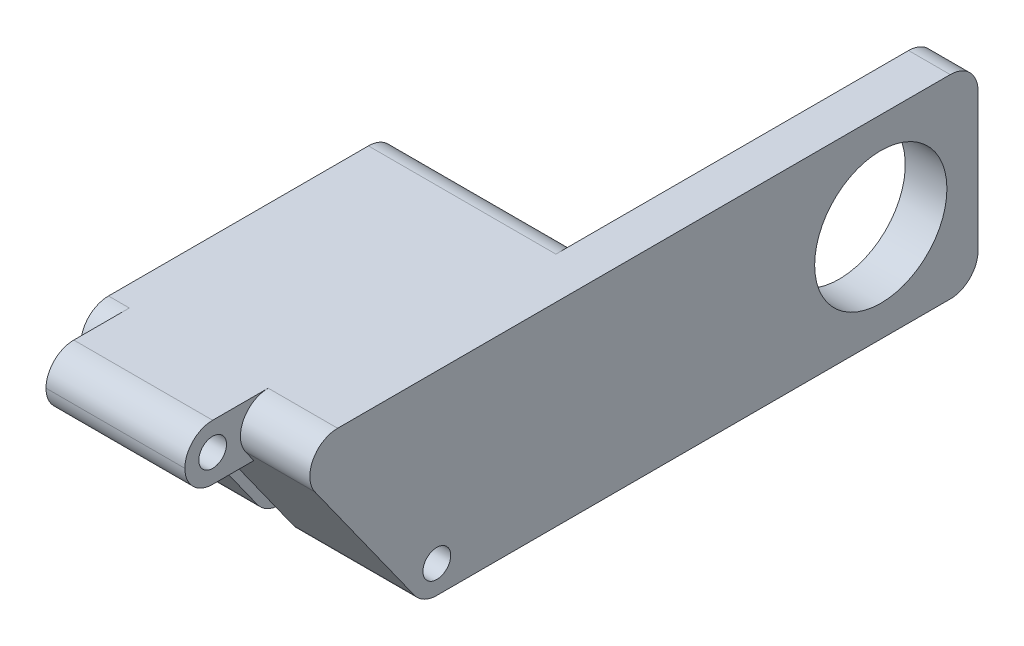
ISO-10303-21;
HEADER;
FILE_DESCRIPTION(('STEP AP214'),'2;1');
FILE_NAME('part.step','',(''),(''),'','','');
FILE_SCHEMA(('AUTOMOTIVE_DESIGN { 1 0 10303 214 1 1 1 1 }'));
ENDSEC;
DATA;
#1=APPLICATION_CONTEXT('core data for automotive mechanical design processes');
#2=APPLICATION_PROTOCOL_DEFINITION('international standard','automotive_design',2000,#1);
#3=PRODUCT_CONTEXT('',#1,'mechanical');
#4=PRODUCT('Part','Part','',(#3));
#5=PRODUCT_RELATED_PRODUCT_CATEGORY('part','',(#4));
#6=PRODUCT_DEFINITION_FORMATION('','',#4);
#7=PRODUCT_DEFINITION_CONTEXT('part definition',#1,'design');
#8=PRODUCT_DEFINITION('design','',#6,#7);
#9=PRODUCT_DEFINITION_SHAPE('','',#8);
#10=(LENGTH_UNIT() NAMED_UNIT(*) SI_UNIT(.MILLI.,.METRE.));
#11=(NAMED_UNIT(*) PLANE_ANGLE_UNIT() SI_UNIT($,.RADIAN.));
#12=(NAMED_UNIT(*) SI_UNIT($,.STERADIAN.) SOLID_ANGLE_UNIT());
#13=UNCERTAINTY_MEASURE_WITH_UNIT(LENGTH_MEASURE(1.E-05),#10,'distance_accuracy_value','');
#14=(GEOMETRIC_REPRESENTATION_CONTEXT(3) GLOBAL_UNCERTAINTY_ASSIGNED_CONTEXT((#13)) GLOBAL_UNIT_ASSIGNED_CONTEXT((#10,
#11,#12)) REPRESENTATION_CONTEXT('',''));
#15=CARTESIAN_POINT('',(0.,0.,0.));
#16=DIRECTION('',(0.,0.,1.));
#17=DIRECTION('',(1.,0.,0.));
#18=AXIS2_PLACEMENT_3D('',#15,#16,#17);
#19=CARTESIAN_POINT('',(-10.,6.99999999999999,46.1136213522735));
#20=DIRECTION('',(0.,-1.,0.));
#21=DIRECTION('',(0.,0.,-1.));
#22=AXIS2_PLACEMENT_3D('',#19,#20,#21);
#23=PLANE('',#22);
#24=DIRECTION('',(1.,0.,0.));
#25=VECTOR('',#24,1.);
#26=CARTESIAN_POINT('',(-10.,6.99999999999999,46.1136213522735));
#27=LINE('',#26,#25);
#28=CARTESIAN_POINT('',(-6.5,6.99999999999999,46.1136213522735));
#29=VERTEX_POINT('',#28);
#30=CARTESIAN_POINT('',(-5.,6.99999999999999,46.1136213522735));
#31=VERTEX_POINT('',#30);
#32=EDGE_CURVE('E328',#29,#31,#27,.T.);
#33=ORIENTED_EDGE('',*,*,#32,.T.);
#34=DIRECTION('',(0.,0.,-1.));
#35=VECTOR('',#34,1.);
#36=CARTESIAN_POINT('',(-5.,7.00000000000001,52.1136213522735));
#37=LINE('',#36,#35);
#38=CARTESIAN_POINT('',(-5.,7.00000000000001,50.1136213522735));
#39=VERTEX_POINT('',#38);
#40=EDGE_CURVE('E392',#39,#31,#37,.T.);
#41=ORIENTED_EDGE('',*,*,#40,.F.);
#42=DIRECTION('',(-1.,0.,0.));
#43=VECTOR('',#42,1.);
#44=CARTESIAN_POINT('',(-5.,6.99999999999999,50.1136213522735));
#45=LINE('',#44,#43);
#46=CARTESIAN_POINT('',(5.,7.00000000000001,50.1136213522735));
#47=VERTEX_POINT('',#46);
#48=EDGE_CURVE('E268',#47,#39,#45,.T.);
#49=ORIENTED_EDGE('',*,*,#48,.F.);
#50=DIRECTION('',(0.,0.,1.));
#51=VECTOR('',#50,1.);
#52=CARTESIAN_POINT('',(5.,7.00000000000001,52.1136213522735));
#53=LINE('',#52,#51);
#54=CARTESIAN_POINT('',(5.,6.99999999999999,46.1136213522735));
#55=VERTEX_POINT('',#54);
#56=EDGE_CURVE('E397',#55,#47,#53,.T.);
#57=ORIENTED_EDGE('',*,*,#56,.F.);
#58=CARTESIAN_POINT('',(10.,6.99999999999999,46.1136213522735));
#59=VERTEX_POINT('',#58);
#60=EDGE_CURVE('E331',#55,#59,#27,.T.);
#61=ORIENTED_EDGE('',*,*,#60,.T.);
#62=DIRECTION('',(0.,0.,1.));
#63=VECTOR('',#62,1.);
#64=CARTESIAN_POINT('',(10.,6.99999999999999,46.1136213522735));
#65=LINE('',#64,#63);
#66=CARTESIAN_POINT('',(10.,7.00000000000001,2.00000000000001));
#67=VERTEX_POINT('',#66);
#68=EDGE_CURVE('E365',#67,#59,#65,.T.);
#69=ORIENTED_EDGE('',*,*,#68,.F.);
#70=DIRECTION('',(1.,0.,0.));
#71=VECTOR('',#70,1.);
#72=CARTESIAN_POINT('',(-10.,7.00000000000001,2.00000000000001));
#73=LINE('',#72,#71);
#74=CARTESIAN_POINT('',(7.,7.00000000000001,2.00000000000001));
#75=VERTEX_POINT('',#74);
#76=EDGE_CURVE('E324',#75,#67,#73,.T.);
#77=ORIENTED_EDGE('',*,*,#76,.F.);
#78=DIRECTION('',(0.,0.,-1.));
#79=VECTOR('',#78,1.);
#80=CARTESIAN_POINT('',(7.,6.99999999999999,46.1136213522735));
#81=LINE('',#80,#79);
#82=CARTESIAN_POINT('',(7.,7.,27.3960780543711));
#83=VERTEX_POINT('',#82);
#84=EDGE_CURVE('E227',#83,#75,#81,.T.);
#85=ORIENTED_EDGE('',*,*,#84,.F.);
#86=DIRECTION('',(1.,0.,0.));
#87=VECTOR('',#86,1.);
#88=CARTESIAN_POINT('',(7.,7.,27.3960780543711));
#89=LINE('',#88,#87);
#90=CARTESIAN_POINT('',(-6.5,7.,27.3960780543711));
#91=VERTEX_POINT('',#90);
#92=EDGE_CURVE('E209',#91,#83,#89,.T.);
#93=ORIENTED_EDGE('',*,*,#92,.F.);
#94=DIRECTION('',(0.,0.,-1.));
#95=VECTOR('',#94,1.);
#96=CARTESIAN_POINT('',(-6.5,6.99999999999999,46.1136213522735));
#97=LINE('',#96,#95);
#98=EDGE_CURVE('E215',#29,#91,#97,.T.);
#99=ORIENTED_EDGE('',*,*,#98,.F.);
#100=EDGE_LOOP('',(#33,#41,#49,#57,#61,#69,#77,#85,#93,#99));
#101=FACE_BOUND('',#100,.T.);
#102=ADVANCED_FACE('F49',(#101),#23,.F.);
#103=CARTESIAN_POINT('',(-10.,-7.,38.9707642094164));
#104=DIRECTION('',(0.,1.,0.));
#105=DIRECTION('',(0.,0.,1.));
#106=AXIS2_PLACEMENT_3D('',#103,#104,#105);
#107=PLANE('',#106);
#108=DIRECTION('',(1.,0.,0.));
#109=VECTOR('',#108,1.);
#110=CARTESIAN_POINT('',(-7.,-6.99999999999998,27.3960780543711));
#111=LINE('',#110,#109);
#112=CARTESIAN_POINT('',(7.,-6.99999999999998,27.3960780543711));
#113=VERTEX_POINT('',#112);
#114=CARTESIAN_POINT('',(-6.5,-6.99999999999998,27.3960780543711));
#115=VERTEX_POINT('',#114);
#116=EDGE_CURVE('E230',#113,#115,#111,.F.);
#117=ORIENTED_EDGE('',*,*,#116,.F.);
#118=DIRECTION('',(0.,0.,1.));
#119=VECTOR('',#118,1.);
#120=CARTESIAN_POINT('',(7.,-7.,38.9707642094164));
#121=LINE('',#120,#119);
#122=CARTESIAN_POINT('',(7.,-6.99999999999993,2.00000000000002));
#123=VERTEX_POINT('',#122);
#124=EDGE_CURVE('E253',#123,#113,#121,.T.);
#125=ORIENTED_EDGE('',*,*,#124,.F.);
#126=DIRECTION('',(1.,0.,0.));
#127=VECTOR('',#126,1.);
#128=CARTESIAN_POINT('',(-10.,-6.99999999999993,2.00000000000001));
#129=LINE('',#128,#127);
#130=CARTESIAN_POINT('',(10.,-6.99999999999993,2.00000000000001));
#131=VERTEX_POINT('',#130);
#132=EDGE_CURVE('E347',#123,#131,#129,.T.);
#133=ORIENTED_EDGE('',*,*,#132,.T.);
#134=DIRECTION('',(0.,0.,-1.));
#135=VECTOR('',#134,1.);
#136=CARTESIAN_POINT('',(10.,-7.,38.9707642094164));
#137=LINE('',#136,#135);
#138=CARTESIAN_POINT('',(10.,-7.,38.9707642094164));
#139=VERTEX_POINT('',#138);
#140=EDGE_CURVE('E351',#139,#131,#137,.T.);
#141=ORIENTED_EDGE('',*,*,#140,.F.);
#142=DIRECTION('',(1.,0.,0.));
#143=VECTOR('',#142,1.);
#144=CARTESIAN_POINT('',(-10.,-7.,38.9707642094164));
#145=LINE('',#144,#143);
#146=CARTESIAN_POINT('',(1.3,-7.00000000000001,38.9707642094164));
#147=VERTEX_POINT('',#146);
#148=EDGE_CURVE('E346',#147,#139,#145,.T.);
#149=ORIENTED_EDGE('',*,*,#148,.F.);
#150=DIRECTION('',(0.,0.,-1.));
#151=VECTOR('',#150,1.);
#152=CARTESIAN_POINT('',(1.3,-7.00000000000001,36.5982311518299));
#153=LINE('',#152,#151);
#154=CARTESIAN_POINT('',(1.3,-7.,36.5982311518299));
#155=VERTEX_POINT('',#154);
#156=EDGE_CURVE('E445',#147,#155,#153,.T.);
#157=ORIENTED_EDGE('',*,*,#156,.T.);
#158=DIRECTION('',(-1.,0.,0.));
#159=VECTOR('',#158,1.);
#160=CARTESIAN_POINT('',(-1.3,-7.00000000000001,36.5982311518299));
#161=LINE('',#160,#159);
#162=CARTESIAN_POINT('',(-1.3,-7.00000000000001,36.5982311518299));
#163=VERTEX_POINT('',#162);
#164=EDGE_CURVE('E441',#155,#163,#161,.T.);
#165=ORIENTED_EDGE('',*,*,#164,.T.);
#166=DIRECTION('',(0.,0.,1.));
#167=VECTOR('',#166,1.);
#168=CARTESIAN_POINT('',(-1.3,-7.00000000000001,36.5982311518299));
#169=LINE('',#168,#167);
#170=CARTESIAN_POINT('',(-1.3,-7.00000000000001,38.9707642094164));
#171=VERTEX_POINT('',#170);
#172=EDGE_CURVE('E436',#163,#171,#169,.T.);
#173=ORIENTED_EDGE('',*,*,#172,.T.);
#174=CARTESIAN_POINT('',(-6.5,-7.,38.9707642094164));
#175=VERTEX_POINT('',#174);
#176=EDGE_CURVE('E342',#175,#171,#145,.T.);
#177=ORIENTED_EDGE('',*,*,#176,.F.);
#178=DIRECTION('',(0.,0.,1.));
#179=VECTOR('',#178,1.);
#180=CARTESIAN_POINT('',(-6.5,-7.,38.9707642094164));
#181=LINE('',#180,#179);
#182=EDGE_CURVE('E483',#115,#175,#181,.T.);
#183=ORIENTED_EDGE('',*,*,#182,.F.);
#184=EDGE_LOOP('',(#117,#125,#133,#141,#149,#157,#165,#173,#177,#183));
#185=FACE_BOUND('',#184,.T.);
#186=ADVANCED_FACE('F528',(#185),#107,.F.);
#187=CARTESIAN_POINT('',(-10.,-5.00000000000001,38.9707642094164));
#188=DIRECTION('',(1.,0.,0.));
#189=DIRECTION('',(0.,0.,1.));
#190=AXIS2_PLACEMENT_3D('',#187,#188,#189);
#191=CYLINDRICAL_SURFACE('',#190,1.99999999999999);
#192=ORIENTED_EDGE('',*,*,#148,.T.);
#193=CARTESIAN_POINT('',(10.,-5.00000000000001,38.9707642094164));
#194=DIRECTION('',(1.,0.,0.));
#195=DIRECTION('',(0.,0.,-1.));
#196=AXIS2_PLACEMENT_3D('',#193,#194,#195);
#197=CIRCLE('',#196,1.99999999999999);
#198=CARTESIAN_POINT('',(10.,-6.16247638743819,40.5982311518299));
#199=VERTEX_POINT('',#198);
#200=EDGE_CURVE('E355',#199,#139,#197,.T.);
#201=ORIENTED_EDGE('',*,*,#200,.F.);
#202=DIRECTION('',(1.,0.,0.));
#203=VECTOR('',#202,1.);
#204=CARTESIAN_POINT('',(-10.,-6.16247638743819,40.5982311518299));
#205=LINE('',#204,#203);
#206=CARTESIAN_POINT('',(1.3,-6.16247638743819,40.5982311518299));
#207=VERTEX_POINT('',#206);
#208=EDGE_CURVE('E341',#207,#199,#205,.T.);
#209=ORIENTED_EDGE('',*,*,#208,.F.);
#210=CARTESIAN_POINT('',(1.3,-5.00000000000001,38.9707642094164));
#211=DIRECTION('',(-1.,0.,0.));
#212=DIRECTION('',(0.,0.,1.));
#213=AXIS2_PLACEMENT_3D('',#210,#211,#212);
#214=CIRCLE('',#213,1.99999999999999);
#215=EDGE_CURVE('E273',#147,#207,#214,.T.);
#216=ORIENTED_EDGE('',*,*,#215,.F.);
#217=EDGE_LOOP('',(#192,#201,#209,#216));
#218=FACE_BOUND('',#217,.T.);
#219=ADVANCED_FACE('F562',(#218),#191,.T.);
#220=CARTESIAN_POINT('',(-10.,-5.00000000000001,38.9707642094164));
#221=DIRECTION('',(1.,0.,0.));
#222=DIRECTION('',(0.,0.,1.));
#223=AXIS2_PLACEMENT_3D('',#220,#221,#222);
#224=CYLINDRICAL_SURFACE('',#223,0.999999999999998);
#225=CARTESIAN_POINT('',(1.3,-5.00000000000001,38.9707642094164));
#226=DIRECTION('',(-1.,0.,0.));
#227=DIRECTION('',(0.,0.,1.));
#228=AXIS2_PLACEMENT_3D('',#225,#226,#227);
#229=CIRCLE('',#228,0.999999999999998);
#230=CARTESIAN_POINT('',(1.3,-5.00000000000001,39.9707642094164));
#231=VERTEX_POINT('',#230);
#232=EDGE_CURVE('E269',#231,#231,#229,.T.);
#233=ORIENTED_EDGE('',*,*,#232,.T.);
#234=EDGE_LOOP('',(#233));
#235=FACE_BOUND('',#234,.T.);
#236=CARTESIAN_POINT('',(10.,-5.00000000000001,38.9707642094164));
#237=DIRECTION('',(1.,0.,0.));
#238=DIRECTION('',(0.,0.,-1.));
#239=AXIS2_PLACEMENT_3D('',#236,#237,#238);
#240=CIRCLE('',#239,0.999999999999998);
#241=CARTESIAN_POINT('',(10.,-5.00000000000001,37.9707642094164));
#242=VERTEX_POINT('',#241);
#243=EDGE_CURVE('E380',#242,#242,#240,.T.);
#244=ORIENTED_EDGE('',*,*,#243,.T.);
#245=EDGE_LOOP('',(#244));
#246=FACE_BOUND('',#245,.T.);
#247=ADVANCED_FACE('F636',(#235,#246),#224,.F.);
#248=CARTESIAN_POINT('',(-10.,4.99999999999999,46.1136213522735));
#249=DIRECTION('',(1.,0.,0.));
#250=DIRECTION('',(0.,0.,1.));
#251=AXIS2_PLACEMENT_3D('',#248,#249,#250);
#252=CYLINDRICAL_SURFACE('',#251,2.);
#253=DIRECTION('',(1.,0.,0.));
#254=VECTOR('',#253,1.);
#255=CARTESIAN_POINT('',(-10.,3.8375236125618,47.741088294687));
#256=LINE('',#255,#254);
#257=CARTESIAN_POINT('',(5.,3.8375236125618,47.741088294687));
#258=VERTEX_POINT('',#257);
#259=CARTESIAN_POINT('',(10.,3.8375236125618,47.741088294687));
#260=VERTEX_POINT('',#259);
#261=EDGE_CURVE('E336',#258,#260,#256,.T.);
#262=ORIENTED_EDGE('',*,*,#261,.T.);
#263=CARTESIAN_POINT('',(10.,4.99999999999999,46.1136213522735));
#264=DIRECTION('',(1.,0.,0.));
#265=DIRECTION('',(0.,0.,1.));
#266=AXIS2_PLACEMENT_3D('',#263,#264,#265);
#267=CIRCLE('',#266,2.);
#268=EDGE_CURVE('E361',#59,#260,#267,.T.);
#269=ORIENTED_EDGE('',*,*,#268,.F.);
#270=ORIENTED_EDGE('',*,*,#60,.F.);
#271=CARTESIAN_POINT('',(5.,4.99999999999999,46.1136213522735));
#272=DIRECTION('',(-1.,0.,0.));
#273=DIRECTION('',(0.,0.,1.));
#274=AXIS2_PLACEMENT_3D('',#271,#272,#273);
#275=CIRCLE('',#274,2.);
#276=EDGE_CURVE('E384',#258,#55,#275,.T.);
#277=ORIENTED_EDGE('',*,*,#276,.F.);
#278=EDGE_LOOP('',(#262,#269,#270,#277));
#279=FACE_BOUND('',#278,.T.);
#280=ADVANCED_FACE('F506',(#279),#252,.T.);
#281=CARTESIAN_POINT('',(10.,-4.99999999999993,2.));
#282=DIRECTION('',(-1.,0.,0.));
#283=DIRECTION('',(0.,0.,-1.));
#284=AXIS2_PLACEMENT_3D('',#281,#282,#283);
#285=PLANE('',#284);
#286=CARTESIAN_POINT('',(10.,0.,7.));
#287=DIRECTION('',(1.,0.,0.));
#288=DIRECTION('',(0.,0.,-1.));
#289=AXIS2_PLACEMENT_3D('',#286,#287,#288);
#290=CIRCLE('',#289,4.7625);
#291=CARTESIAN_POINT('',(10.,0.,2.2375));
#292=VERTEX_POINT('',#291);
#293=EDGE_CURVE('E249',#292,#292,#290,.T.);
#294=ORIENTED_EDGE('',*,*,#293,.F.);
#295=EDGE_LOOP('',(#294));
#296=FACE_BOUND('',#295,.T.);
#297=CARTESIAN_POINT('',(10.,-4.99999999999993,2.));
#298=DIRECTION('',(1.,0.,0.));
#299=DIRECTION('',(0.,0.,-1.));
#300=AXIS2_PLACEMENT_3D('',#297,#298,#299);
#301=CIRCLE('',#300,2.);
#302=CARTESIAN_POINT('',(10.,-4.99999999999991,0.));
#303=VERTEX_POINT('',#302);
#304=EDGE_CURVE('E376',#131,#303,#301,.T.);
#305=ORIENTED_EDGE('',*,*,#304,.T.);
#306=DIRECTION('',(0.,1.,0.));
#307=VECTOR('',#306,1.);
#308=CARTESIAN_POINT('',(10.,-4.99999999999991,0.));
#309=LINE('',#308,#307);
#310=CARTESIAN_POINT('',(10.,4.99999999999999,0.));
#311=VERTEX_POINT('',#310);
#312=EDGE_CURVE('E372',#303,#311,#309,.T.);
#313=ORIENTED_EDGE('',*,*,#312,.T.);
#314=CARTESIAN_POINT('',(10.,5.00000000000001,2.));
#315=DIRECTION('',(1.,0.,0.));
#316=DIRECTION('',(0.,0.,1.));
#317=AXIS2_PLACEMENT_3D('',#314,#315,#316);
#318=CIRCLE('',#317,2.);
#319=EDGE_CURVE('E369',#311,#67,#318,.T.);
#320=ORIENTED_EDGE('',*,*,#319,.T.);
#321=ORIENTED_EDGE('',*,*,#68,.T.);
#322=ORIENTED_EDGE('',*,*,#268,.T.);
#323=DIRECTION('',(0.,-0.813733471206735,-0.581238193719097));
#324=VECTOR('',#323,1.);
#325=CARTESIAN_POINT('',(10.,3.8375236125618,47.741088294687));
#326=LINE('',#325,#324);
#327=EDGE_CURVE('E358',#260,#199,#326,.T.);
#328=ORIENTED_EDGE('',*,*,#327,.T.);
#329=ORIENTED_EDGE('',*,*,#200,.T.);
#330=ORIENTED_EDGE('',*,*,#140,.T.);
#331=EDGE_LOOP('',(#305,#313,#320,#321,#322,#328,#329,#330));
#332=FACE_BOUND('',#331,.T.);
#333=ORIENTED_EDGE('',*,*,#243,.F.);
#334=EDGE_LOOP('',(#333));
#335=FACE_BOUND('',#334,.T.);
#336=ADVANCED_FACE('F509',(#296,#332,#335),#285,.F.);
#337=CARTESIAN_POINT('',(-10.,-4.99999999999993,2.));
#338=DIRECTION('',(1.,0.,0.));
#339=DIRECTION('',(0.,0.,1.));
#340=AXIS2_PLACEMENT_3D('',#337,#338,#339);
#341=CYLINDRICAL_SURFACE('',#340,2.);
#342=DIRECTION('',(1.,0.,0.));
#343=VECTOR('',#342,1.);
#344=CARTESIAN_POINT('',(-10.,-4.99999999999991,0.));
#345=LINE('',#344,#343);
#346=CARTESIAN_POINT('',(7.,-4.99999999999991,0.));
#347=VERTEX_POINT('',#346);
#348=EDGE_CURVE('E318',#347,#303,#345,.T.);
#349=ORIENTED_EDGE('',*,*,#348,.T.);
#350=ORIENTED_EDGE('',*,*,#304,.F.);
#351=ORIENTED_EDGE('',*,*,#132,.F.);
#352=CARTESIAN_POINT('',(7.,-4.99999999999993,2.));
#353=DIRECTION('',(-1.,0.,0.));
#354=DIRECTION('',(0.,0.,1.));
#355=AXIS2_PLACEMENT_3D('',#352,#353,#354);
#356=CIRCLE('',#355,2.);
#357=EDGE_CURVE('E248',#347,#123,#356,.T.);
#358=ORIENTED_EDGE('',*,*,#357,.F.);
#359=EDGE_LOOP('',(#349,#350,#351,#358));
#360=FACE_BOUND('',#359,.T.);
#361=ADVANCED_FACE('F522',(#360),#341,.T.);
#362=CARTESIAN_POINT('',(-10.,-4.99999999999991,0.));
#363=DIRECTION('',(0.,0.,1.));
#364=DIRECTION('',(-1.,0.,0.));
#365=AXIS2_PLACEMENT_3D('',#362,#363,#364);
#366=PLANE('',#365);
#367=DIRECTION('',(1.,0.,0.));
#368=VECTOR('',#367,1.);
#369=CARTESIAN_POINT('',(-10.,4.99999999999999,0.));
#370=LINE('',#369,#368);
#371=CARTESIAN_POINT('',(7.,4.99999999999999,0.));
#372=VERTEX_POINT('',#371);
#373=EDGE_CURVE('E321',#372,#311,#370,.T.);
#374=ORIENTED_EDGE('',*,*,#373,.T.);
#375=ORIENTED_EDGE('',*,*,#312,.F.);
#376=ORIENTED_EDGE('',*,*,#348,.F.);
#377=DIRECTION('',(0.,-1.,0.));
#378=VECTOR('',#377,1.);
#379=CARTESIAN_POINT('',(7.,-4.99999999999991,0.));
#380=LINE('',#379,#378);
#381=EDGE_CURVE('E466',#372,#347,#380,.T.);
#382=ORIENTED_EDGE('',*,*,#381,.F.);
#383=EDGE_LOOP('',(#374,#375,#376,#382));
#384=FACE_BOUND('',#383,.T.);
#385=ADVANCED_FACE('F520',(#384),#366,.F.);
#386=CARTESIAN_POINT('',(-10.,5.00000000000001,2.));
#387=DIRECTION('',(1.,0.,0.));
#388=DIRECTION('',(0.,0.,1.));
#389=AXIS2_PLACEMENT_3D('',#386,#387,#388);
#390=CYLINDRICAL_SURFACE('',#389,2.);
#391=ORIENTED_EDGE('',*,*,#76,.T.);
#392=ORIENTED_EDGE('',*,*,#319,.F.);
#393=ORIENTED_EDGE('',*,*,#373,.F.);
#394=CARTESIAN_POINT('',(7.,5.00000000000001,2.));
#395=DIRECTION('',(-1.,0.,0.));
#396=DIRECTION('',(0.,0.,1.));
#397=AXIS2_PLACEMENT_3D('',#394,#395,#396);
#398=CIRCLE('',#397,2.);
#399=EDGE_CURVE('E463',#75,#372,#398,.T.);
#400=ORIENTED_EDGE('',*,*,#399,.F.);
#401=EDGE_LOOP('',(#391,#392,#393,#400));
#402=FACE_BOUND('',#401,.T.);
#403=ADVANCED_FACE('F515',(#402),#390,.T.);
#404=CARTESIAN_POINT('',(-6.5,3.8375236125618,47.741088294687));
#405=VERTEX_POINT('',#404);
#406=CARTESIAN_POINT('',(-5.,3.8375236125618,47.741088294687));
#407=VERTEX_POINT('',#406);
#408=EDGE_CURVE('E332',#405,#407,#256,.T.);
#409=ORIENTED_EDGE('',*,*,#408,.T.);
#410=CARTESIAN_POINT('',(-5.,4.99999999999999,46.1136213522735));
#411=DIRECTION('',(1.,0.,0.));
#412=DIRECTION('',(0.,0.,-1.));
#413=AXIS2_PLACEMENT_3D('',#410,#411,#412);
#414=CIRCLE('',#413,2.);
#415=EDGE_CURVE('E387',#31,#407,#414,.T.);
#416=ORIENTED_EDGE('',*,*,#415,.F.);
#417=ORIENTED_EDGE('',*,*,#32,.F.);
#418=CARTESIAN_POINT('',(-6.5,4.99999999999999,46.1136213522735));
#419=DIRECTION('',(-1.,0.,0.));
#420=DIRECTION('',(0.,0.,1.));
#421=AXIS2_PLACEMENT_3D('',#418,#419,#420);
#422=CIRCLE('',#421,2.);
#423=EDGE_CURVE('E218',#405,#29,#422,.T.);
#424=ORIENTED_EDGE('',*,*,#423,.F.);
#425=EDGE_LOOP('',(#409,#416,#417,#424));
#426=FACE_BOUND('',#425,.T.);
#427=ADVANCED_FACE('F543',(#426),#252,.T.);
#428=CARTESIAN_POINT('',(-10.,3.8375236125618,47.741088294687));
#429=DIRECTION('',(0.,0.581238193719097,-0.813733471206735));
#430=DIRECTION('',(0.,0.813733471206735,0.581238193719097));
#431=AXIS2_PLACEMENT_3D('',#428,#429,#430);
#432=PLANE('',#431);
#433=CARTESIAN_POINT('',(-6.5,-6.16247638743819,40.5982311518299));
#434=VERTEX_POINT('',#433);
#435=CARTESIAN_POINT('',(-1.3,-6.16247638743819,40.5982311518299));
#436=VERTEX_POINT('',#435);
#437=EDGE_CURVE('E337',#434,#436,#205,.T.);
#438=ORIENTED_EDGE('',*,*,#437,.T.);
#439=DIRECTION('',(0.,-0.813733471206735,-0.581238193719097));
#440=VECTOR('',#439,1.);
#441=CARTESIAN_POINT('',(-1.3,3.8375236125618,47.741088294687));
#442=LINE('',#441,#440);
#443=CARTESIAN_POINT('',(-1.3,-0.562476387438172,44.5982311518299));
#444=VERTEX_POINT('',#443);
#445=EDGE_CURVE('E274',#444,#436,#442,.T.);
#446=ORIENTED_EDGE('',*,*,#445,.F.);
#447=DIRECTION('',(-1.,0.,0.));
#448=VECTOR('',#447,1.);
#449=CARTESIAN_POINT('',(-10.,-0.562476387438169,44.5982311518299));
#450=LINE('',#449,#448);
#451=CARTESIAN_POINT('',(1.3,-0.562476387438169,44.5982311518299));
#452=VERTEX_POINT('',#451);
#453=EDGE_CURVE('E257',#452,#444,#450,.T.);
#454=ORIENTED_EDGE('',*,*,#453,.F.);
#455=DIRECTION('',(0.,0.813733471206735,0.581238193719097));
#456=VECTOR('',#455,1.);
#457=CARTESIAN_POINT('',(1.3,3.8375236125618,47.741088294687));
#458=LINE('',#457,#456);
#459=EDGE_CURVE('E285',#207,#452,#458,.T.);
#460=ORIENTED_EDGE('',*,*,#459,.F.);
#461=ORIENTED_EDGE('',*,*,#208,.T.);
#462=ORIENTED_EDGE('',*,*,#327,.F.);
#463=ORIENTED_EDGE('',*,*,#261,.F.);
#464=DIRECTION('',(0.,0.813733471206735,0.581238193719097));
#465=VECTOR('',#464,1.);
#466=CARTESIAN_POINT('',(5.,3.8375236125618,47.741088294687));
#467=LINE('',#466,#465);
#468=CARTESIAN_POINT('',(5.,3.00000000000001,47.1428571428571));
#469=VERTEX_POINT('',#468);
#470=EDGE_CURVE('E307',#469,#258,#467,.T.);
#471=ORIENTED_EDGE('',*,*,#470,.F.);
#472=DIRECTION('',(-1.,0.,0.));
#473=VECTOR('',#472,1.);
#474=CARTESIAN_POINT('',(-10.,3.00000000000001,47.1428571428571));
#475=LINE('',#474,#473);
#476=CARTESIAN_POINT('',(-5.,3.00000000000001,47.1428571428571));
#477=VERTEX_POINT('',#476);
#478=EDGE_CURVE('E314',#469,#477,#475,.T.);
#479=ORIENTED_EDGE('',*,*,#478,.T.);
#480=DIRECTION('',(0.,-0.813733471206735,-0.581238193719097));
#481=VECTOR('',#480,1.);
#482=CARTESIAN_POINT('',(-5.,3.8375236125618,47.741088294687));
#483=LINE('',#482,#481);
#484=EDGE_CURVE('E310',#407,#477,#483,.T.);
#485=ORIENTED_EDGE('',*,*,#484,.F.);
#486=ORIENTED_EDGE('',*,*,#408,.F.);
#487=DIRECTION('',(0.,0.813733471206735,0.581238193719097));
#488=VECTOR('',#487,1.);
#489=CARTESIAN_POINT('',(-6.5,3.8375236125618,47.741088294687));
#490=LINE('',#489,#488);
#491=EDGE_CURVE('E477',#434,#405,#490,.T.);
#492=ORIENTED_EDGE('',*,*,#491,.F.);
#493=EDGE_LOOP('',(#438,#446,#454,#460,#461,#462,#463,#471,#479,#485,#486,#492));
#494=FACE_BOUND('',#493,.T.);
#495=ADVANCED_FACE('F539',(#494),#432,.F.);
#496=ORIENTED_EDGE('',*,*,#176,.T.);
#497=CARTESIAN_POINT('',(-1.3,-5.00000000000001,38.9707642094164));
#498=DIRECTION('',(1.,0.,0.));
#499=DIRECTION('',(0.,0.,-1.));
#500=AXIS2_PLACEMENT_3D('',#497,#498,#499);
#501=CIRCLE('',#500,1.99999999999999);
#502=EDGE_CURVE('E279',#436,#171,#501,.T.);
#503=ORIENTED_EDGE('',*,*,#502,.F.);
#504=ORIENTED_EDGE('',*,*,#437,.F.);
#505=CARTESIAN_POINT('',(-6.5,-5.00000000000001,38.9707642094164));
#506=DIRECTION('',(-1.,0.,0.));
#507=DIRECTION('',(0.,0.,1.));
#508=AXIS2_PLACEMENT_3D('',#505,#506,#507);
#509=CIRCLE('',#508,1.99999999999999);
#510=EDGE_CURVE('E480',#175,#434,#509,.T.);
#511=ORIENTED_EDGE('',*,*,#510,.F.);
#512=EDGE_LOOP('',(#496,#503,#504,#511));
#513=FACE_BOUND('',#512,.T.);
#514=ADVANCED_FACE('F535',(#513),#191,.T.);
#515=CARTESIAN_POINT('',(-6.5,-5.00000000000001,38.9707642094164));
#516=DIRECTION('',(-1.,0.,0.));
#517=DIRECTION('',(0.,0.,1.));
#518=AXIS2_PLACEMENT_3D('',#515,#516,#517);
#519=CIRCLE('',#518,0.999999999999998);
#520=CARTESIAN_POINT('',(-6.5,-5.00000000000001,39.9707642094164));
#521=VERTEX_POINT('',#520);
#522=EDGE_CURVE('E263',#521,#521,#519,.T.);
#523=ORIENTED_EDGE('',*,*,#522,.T.);
#524=EDGE_LOOP('',(#523));
#525=FACE_BOUND('',#524,.T.);
#526=CARTESIAN_POINT('',(-1.3,-5.00000000000001,38.9707642094164));
#527=DIRECTION('',(1.,0.,0.));
#528=DIRECTION('',(0.,0.,-1.));
#529=AXIS2_PLACEMENT_3D('',#526,#527,#528);
#530=CIRCLE('',#529,0.999999999999998);
#531=CARTESIAN_POINT('',(-1.3,-5.00000000000001,37.9707642094164));
#532=VERTEX_POINT('',#531);
#533=EDGE_CURVE('E275',#532,#532,#530,.T.);
#534=ORIENTED_EDGE('',*,*,#533,.T.);
#535=EDGE_LOOP('',(#534));
#536=FACE_BOUND('',#535,.T.);
#537=ADVANCED_FACE('F632',(#525,#536),#224,.F.);
#538=CARTESIAN_POINT('',(5.,3.00000000000001,52.1136213522735));
#539=DIRECTION('',(1.,0.,0.));
#540=DIRECTION('',(0.,0.,1.));
#541=AXIS2_PLACEMENT_3D('',#538,#539,#540);
#542=PLANE('',#541);
#543=CARTESIAN_POINT('',(5.,5.00000000000001,50.1136213522735));
#544=DIRECTION('',(-1.,0.,0.));
#545=DIRECTION('',(0.,0.,1.));
#546=AXIS2_PLACEMENT_3D('',#543,#544,#545);
#547=CIRCLE('',#546,0.999999999999998);
#548=CARTESIAN_POINT('',(5.,5.00000000000001,49.1136213522735));
#549=VERTEX_POINT('',#548);
#550=EDGE_CURVE('E284',#549,#549,#547,.F.);
#551=ORIENTED_EDGE('',*,*,#550,.F.);
#552=EDGE_LOOP('',(#551));
#553=FACE_BOUND('',#552,.T.);
#554=DIRECTION('',(0.,0.,1.));
#555=VECTOR('',#554,1.);
#556=CARTESIAN_POINT('',(5.,3.00000000000001,52.1136213522735));
#557=LINE('',#556,#555);
#558=CARTESIAN_POINT('',(5.,3.00000000000001,50.1136213522735));
#559=VERTEX_POINT('',#558);
#560=EDGE_CURVE('E396',#469,#559,#557,.T.);
#561=ORIENTED_EDGE('',*,*,#560,.F.);
#562=ORIENTED_EDGE('',*,*,#470,.T.);
#563=ORIENTED_EDGE('',*,*,#276,.T.);
#564=ORIENTED_EDGE('',*,*,#56,.T.);
#565=CARTESIAN_POINT('',(5.,4.99999999999999,50.1136213522735));
#566=DIRECTION('',(-1.,0.,0.));
#567=DIRECTION('',(0.,0.,1.));
#568=AXIS2_PLACEMENT_3D('',#565,#566,#567);
#569=CIRCLE('',#568,2.);
#570=CARTESIAN_POINT('',(5.,4.99999999999999,52.1136213522735));
#571=VERTEX_POINT('',#570);
#572=EDGE_CURVE('E293',#571,#47,#569,.T.);
#573=ORIENTED_EDGE('',*,*,#572,.F.);
#574=CARTESIAN_POINT('',(5.,5.00000000000001,50.1136213522735));
#575=DIRECTION('',(-1.,0.,0.));
#576=DIRECTION('',(0.,0.,1.));
#577=AXIS2_PLACEMENT_3D('',#574,#575,#576);
#578=CIRCLE('',#577,2.);
#579=EDGE_CURVE('E289',#559,#571,#578,.T.);
#580=ORIENTED_EDGE('',*,*,#579,.F.);
#581=EDGE_LOOP('',(#561,#562,#563,#564,#573,#580));
#582=FACE_BOUND('',#581,.T.);
#583=ADVANCED_FACE('F554',(#553,#582),#542,.T.);
#584=CARTESIAN_POINT('',(-5.,3.00000000000001,52.1136213522735));
#585=DIRECTION('',(-1.,0.,0.));
#586=DIRECTION('',(0.,0.,-1.));
#587=AXIS2_PLACEMENT_3D('',#584,#585,#586);
#588=PLANE('',#587);
#589=CARTESIAN_POINT('',(-5.,5.00000000000001,50.1136213522735));
#590=DIRECTION('',(1.,0.,0.));
#591=DIRECTION('',(0.,0.,-1.));
#592=AXIS2_PLACEMENT_3D('',#589,#590,#591);
#593=CIRCLE('',#592,0.999999999999998);
#594=CARTESIAN_POINT('',(-5.,5.00000000000001,49.1136213522735));
#595=VERTEX_POINT('',#594);
#596=EDGE_CURVE('E401',#595,#595,#593,.T.);
#597=ORIENTED_EDGE('',*,*,#596,.T.);
#598=EDGE_LOOP('',(#597));
#599=FACE_BOUND('',#598,.T.);
#600=CARTESIAN_POINT('',(-5.,4.99999999999999,50.1136213522735));
#601=DIRECTION('',(1.,0.,0.));
#602=DIRECTION('',(0.,0.,-1.));
#603=AXIS2_PLACEMENT_3D('',#600,#601,#602);
#604=CIRCLE('',#603,2.);
#605=CARTESIAN_POINT('',(-5.,4.99999999999999,52.1136213522735));
#606=VERTEX_POINT('',#605);
#607=EDGE_CURVE('E303',#39,#606,#604,.T.);
#608=ORIENTED_EDGE('',*,*,#607,.F.);
#609=ORIENTED_EDGE('',*,*,#40,.T.);
#610=ORIENTED_EDGE('',*,*,#415,.T.);
#611=ORIENTED_EDGE('',*,*,#484,.T.);
#612=DIRECTION('',(0.,0.,-1.));
#613=VECTOR('',#612,1.);
#614=CARTESIAN_POINT('',(-5.,3.00000000000001,52.1136213522735));
#615=LINE('',#614,#613);
#616=CARTESIAN_POINT('',(-5.,3.00000000000001,50.1136213522735));
#617=VERTEX_POINT('',#616);
#618=EDGE_CURVE('E391',#617,#477,#615,.T.);
#619=ORIENTED_EDGE('',*,*,#618,.F.);
#620=CARTESIAN_POINT('',(-5.,5.00000000000001,50.1136213522735));
#621=DIRECTION('',(1.,0.,0.));
#622=DIRECTION('',(0.,0.,-1.));
#623=AXIS2_PLACEMENT_3D('',#620,#621,#622);
#624=CIRCLE('',#623,2.);
#625=EDGE_CURVE('E299',#606,#617,#624,.T.);
#626=ORIENTED_EDGE('',*,*,#625,.F.);
#627=EDGE_LOOP('',(#608,#609,#610,#611,#619,#626));
#628=FACE_BOUND('',#627,.T.);
#629=ADVANCED_FACE('F546',(#599,#628),#588,.T.);
#630=CARTESIAN_POINT('',(0.,3.00000000000001,0.));
#631=DIRECTION('',(0.,1.,0.));
#632=DIRECTION('',(0.,0.,1.));
#633=AXIS2_PLACEMENT_3D('',#630,#631,#632);
#634=PLANE('',#633);
#635=ORIENTED_EDGE('',*,*,#618,.T.);
#636=ORIENTED_EDGE('',*,*,#478,.F.);
#637=ORIENTED_EDGE('',*,*,#560,.T.);
#638=DIRECTION('',(-1.,0.,0.));
#639=VECTOR('',#638,1.);
#640=CARTESIAN_POINT('',(5.,3.00000000000001,50.1136213522735));
#641=LINE('',#640,#639);
#642=EDGE_CURVE('E296',#617,#559,#641,.F.);
#643=ORIENTED_EDGE('',*,*,#642,.F.);
#644=EDGE_LOOP('',(#635,#636,#637,#643));
#645=FACE_BOUND('',#644,.T.);
#646=ADVANCED_FACE('F649',(#645),#634,.F.);
#647=CARTESIAN_POINT('',(10.001,5.00000000000001,50.1136213522735));
#648=DIRECTION('',(-1.,0.,0.));
#649=DIRECTION('',(0.,0.,-1.));
#650=AXIS2_PLACEMENT_3D('',#647,#648,#649);
#651=CYLINDRICAL_SURFACE('',#650,0.999999999999998);
#652=CARTESIAN_POINT('',(5.,5.00000000000001,49.1136213522735));
#653=CARTESIAN_POINT('',(4.89583333333334,5.00000000000001,49.1136213522735));
#654=CARTESIAN_POINT('',(4.79166666666667,5.00000000000001,49.1136213522735));
#655=CARTESIAN_POINT('',(4.58333333333333,5.00000000000001,49.1136213522735));
#656=CARTESIAN_POINT('',(4.47916666666667,5.00000000000001,49.1136213522735));
#657=CARTESIAN_POINT('',(4.27083333333333,5.00000000000001,49.1136213522735));
#658=CARTESIAN_POINT('',(4.16666666666667,5.00000000000001,49.1136213522735));
#659=CARTESIAN_POINT('',(3.95833333333334,5.00000000000001,49.1136213522735));
#660=CARTESIAN_POINT('',(3.85416666666667,5.00000000000001,49.1136213522735));
#661=CARTESIAN_POINT('',(3.64583333333333,5.00000000000001,49.1136213522735));
#662=CARTESIAN_POINT('',(3.54166666666667,5.00000000000001,49.1136213522735));
#663=CARTESIAN_POINT('',(3.33333333333333,5.00000000000001,49.1136213522735));
#664=CARTESIAN_POINT('',(3.22916666666667,5.00000000000001,49.1136213522735));
#665=CARTESIAN_POINT('',(3.02083333333333,5.00000000000001,49.1136213522735));
#666=CARTESIAN_POINT('',(2.91666666666667,5.00000000000001,49.1136213522735));
#667=CARTESIAN_POINT('',(2.70833333333333,5.00000000000001,49.1136213522735));
#668=CARTESIAN_POINT('',(2.60416666666667,5.00000000000001,49.1136213522735));
#669=CARTESIAN_POINT('',(2.39583333333333,5.00000000000001,49.1136213522735));
#670=CARTESIAN_POINT('',(2.29166666666667,5.00000000000001,49.1136213522735));
#671=CARTESIAN_POINT('',(2.08333333333334,5.00000000000001,49.1136213522735));
#672=CARTESIAN_POINT('',(1.97916666666667,5.00000000000001,49.1136213522735));
#673=CARTESIAN_POINT('',(1.77083333333334,5.00000000000001,49.1136213522735));
#674=CARTESIAN_POINT('',(1.66666666666667,5.00000000000001,49.1136213522735));
#675=CARTESIAN_POINT('',(1.45833333333334,5.00000000000001,49.1136213522735));
#676=CARTESIAN_POINT('',(1.35416666666667,5.00000000000001,49.1136213522735));
#677=CARTESIAN_POINT('',(1.14583333333334,5.00000000000001,49.1136213522735));
#678=CARTESIAN_POINT('',(1.04166666666667,5.00000000000001,49.1136213522735));
#679=CARTESIAN_POINT('',(0.833333333333336,5.00000000000001,49.1136213522735));
#680=CARTESIAN_POINT('',(0.729166666666669,5.00000000000001,49.1136213522735));
#681=CARTESIAN_POINT('',(0.520833333333336,5.00000000000001,49.1136213522735));
#682=CARTESIAN_POINT('',(0.416666666666669,5.00000000000001,49.1136213522735));
#683=CARTESIAN_POINT('',(0.208333333333335,5.00000000000001,49.1136213522735));
#684=CARTESIAN_POINT('',(0.104166666666668,5.00000000000001,49.1136213522735));
#685=CARTESIAN_POINT('',(-0.104166666666665,5.00000000000001,49.1136213522735));
#686=CARTESIAN_POINT('',(-0.208333333333332,5.00000000000001,49.1136213522735));
#687=CARTESIAN_POINT('',(-0.416666666666665,5.00000000000001,49.1136213522735));
#688=CARTESIAN_POINT('',(-0.520833333333332,5.00000000000001,49.1136213522735));
#689=CARTESIAN_POINT('',(-0.729166666666666,5.00000000000001,49.1136213522735));
#690=CARTESIAN_POINT('',(-0.833333333333332,5.00000000000001,49.1136213522735));
#691=CARTESIAN_POINT('',(-1.04166666666667,5.00000000000001,49.1136213522735));
#692=CARTESIAN_POINT('',(-1.14583333333333,5.00000000000001,49.1136213522735));
#693=CARTESIAN_POINT('',(-1.35416666666667,5.00000000000001,49.1136213522735));
#694=CARTESIAN_POINT('',(-1.45833333333333,5.00000000000001,49.1136213522735));
#695=CARTESIAN_POINT('',(-1.66666666666667,5.00000000000001,49.1136213522735));
#696=CARTESIAN_POINT('',(-1.77083333333333,5.00000000000001,49.1136213522735));
#697=CARTESIAN_POINT('',(-1.97916666666667,5.00000000000001,49.1136213522735));
#698=CARTESIAN_POINT('',(-2.08333333333333,5.00000000000001,49.1136213522735));
#699=CARTESIAN_POINT('',(-2.29166666666667,5.00000000000001,49.1136213522735));
#700=CARTESIAN_POINT('',(-2.39583333333333,5.00000000000001,49.1136213522735));
#701=CARTESIAN_POINT('',(-2.60416666666667,5.00000000000001,49.1136213522735));
#702=CARTESIAN_POINT('',(-2.70833333333333,5.00000000000001,49.1136213522735));
#703=CARTESIAN_POINT('',(-2.91666666666667,5.00000000000001,49.1136213522735));
#704=CARTESIAN_POINT('',(-3.02083333333333,5.00000000000001,49.1136213522735));
#705=CARTESIAN_POINT('',(-3.22916666666667,5.00000000000001,49.1136213522735));
#706=CARTESIAN_POINT('',(-3.33333333333333,5.00000000000001,49.1136213522735));
#707=CARTESIAN_POINT('',(-3.54166666666667,5.00000000000001,49.1136213522735));
#708=CARTESIAN_POINT('',(-3.64583333333333,5.00000000000001,49.1136213522735));
#709=CARTESIAN_POINT('',(-3.85416666666667,5.00000000000001,49.1136213522735));
#710=CARTESIAN_POINT('',(-3.95833333333333,5.00000000000001,49.1136213522735));
#711=CARTESIAN_POINT('',(-4.16666666666667,5.00000000000001,49.1136213522735));
#712=CARTESIAN_POINT('',(-4.27083333333333,5.00000000000001,49.1136213522735));
#713=CARTESIAN_POINT('',(-4.47916666666667,5.00000000000001,49.1136213522735));
#714=CARTESIAN_POINT('',(-4.58333333333333,5.00000000000001,49.1136213522735));
#715=CARTESIAN_POINT('',(-4.79166666666667,5.00000000000001,49.1136213522735));
#716=CARTESIAN_POINT('',(-4.89583333333333,5.00000000000001,49.1136213522735));
#717=CARTESIAN_POINT('',(-5.,5.00000000000001,49.1136213522735));
#718=B_SPLINE_CURVE_WITH_KNOTS('',3,(#652,#653,#654,#655,#656,#657,#658,#659,#660,#661,#662,
#663,#664,#665,#666,#667,#668,#669,#670,#671,#672,#673,#674,#675,#676,#677,#678,#679,#680,#681,
#682,#683,#684,#685,#686,#687,#688,#689,#690,#691,#692,#693,#694,#695,#696,#697,#698,#699,#700,
#701,#702,#703,#704,#705,#706,#707,#708,#709,#710,#711,#712,#713,#714,#715,#716,#717),
.UNSPECIFIED.,.F.,.F.,(4,2,2,2,2,2,2,2,2,2,2,2,2,2,2,2,2,2,2,2,2,2,2,2,2,2,2,2,2,2,2,2,4),(0.,
0.3125,0.625000000000001,0.9375,1.25,1.5625,1.875,2.1875,2.5,2.8125,3.125,3.4375,3.75,4.0625,
4.375,4.6875,5.,5.3125,5.625,5.9375,6.25,6.5625,6.875,7.1875,7.5,7.8125,8.125,8.4375,8.75,
9.0625,9.375,9.6875,10.),.UNSPECIFIED.);
#719=EDGE_CURVE('BSEAM610',#549,#595,#718,.T.);
#720=ORIENTED_EDGE('',*,*,#550,.T.);
#721=ORIENTED_EDGE('',*,*,#596,.F.);
#722=ORIENTED_EDGE('',*,*,#719,.T.);
#723=ORIENTED_EDGE('',*,*,#719,.F.);
#724=EDGE_LOOP('',(#720,#722,#721,#723));
#725=FACE_BOUND('',#724,.T.);
#726=ADVANCED_FACE('F610',(#725),#651,.F.);
#727=CARTESIAN_POINT('',(-10.,4.99999999999999,50.1136213522735));
#728=DIRECTION('',(1.,0.,0.));
#729=DIRECTION('',(0.,0.,1.));
#730=AXIS2_PLACEMENT_3D('',#727,#728,#729);
#731=CYLINDRICAL_SURFACE('',#730,2.);
#732=ORIENTED_EDGE('',*,*,#48,.T.);
#733=ORIENTED_EDGE('',*,*,#607,.T.);
#734=DIRECTION('',(-1.,0.,0.));
#735=VECTOR('',#734,1.);
#736=CARTESIAN_POINT('',(5.,4.99999999999999,52.1136213522735));
#737=LINE('',#736,#735);
#738=EDGE_CURVE('E281',#606,#571,#737,.F.);
#739=ORIENTED_EDGE('',*,*,#738,.T.);
#740=ORIENTED_EDGE('',*,*,#572,.T.);
#741=EDGE_LOOP('',(#732,#733,#739,#740));
#742=FACE_BOUND('',#741,.T.);
#743=ADVANCED_FACE('F550',(#742),#731,.T.);
#744=CARTESIAN_POINT('',(-5.,5.00000000000001,50.1136213522735));
#745=DIRECTION('',(1.,0.,0.));
#746=DIRECTION('',(0.,0.,1.));
#747=AXIS2_PLACEMENT_3D('',#744,#745,#746);
#748=CYLINDRICAL_SURFACE('',#747,2.);
#749=ORIENTED_EDGE('',*,*,#579,.T.);
#750=ORIENTED_EDGE('',*,*,#738,.F.);
#751=ORIENTED_EDGE('',*,*,#625,.T.);
#752=ORIENTED_EDGE('',*,*,#642,.T.);
#753=EDGE_LOOP('',(#749,#750,#751,#752));
#754=FACE_BOUND('',#753,.T.);
#755=ADVANCED_FACE('F605',(#754),#748,.T.);
#756=CARTESIAN_POINT('',(-1.3,0.,44.5982311518299));
#757=DIRECTION('',(0.,0.,1.));
#758=DIRECTION('',(0.,-1.,0.));
#759=AXIS2_PLACEMENT_3D('',#756,#757,#758);
#760=PLANE('',#759);
#761=DIRECTION('',(0.,-1.,0.));
#762=VECTOR('',#761,1.);
#763=CARTESIAN_POINT('',(1.3,0.,44.5982311518299));
#764=LINE('',#763,#762);
#765=CARTESIAN_POINT('',(1.3,0.,44.5982311518299));
#766=VERTEX_POINT('',#765);
#767=EDGE_CURVE('E280',#766,#452,#764,.T.);
#768=ORIENTED_EDGE('',*,*,#767,.T.);
#769=ORIENTED_EDGE('',*,*,#453,.T.);
#770=DIRECTION('',(0.,-1.,0.));
#771=VECTOR('',#770,1.);
#772=CARTESIAN_POINT('',(-1.3,0.,44.5982311518299));
#773=LINE('',#772,#771);
#774=CARTESIAN_POINT('',(-1.3,0.,44.5982311518299));
#775=VERTEX_POINT('',#774);
#776=EDGE_CURVE('E431',#775,#444,#773,.T.);
#777=ORIENTED_EDGE('',*,*,#776,.F.);
#778=DIRECTION('',(1.,0.,0.));
#779=VECTOR('',#778,1.);
#780=CARTESIAN_POINT('',(-1.3,0.,44.5982311518299));
#781=LINE('',#780,#779);
#782=EDGE_CURVE('E428',#775,#766,#781,.T.);
#783=ORIENTED_EDGE('',*,*,#782,.T.);
#784=EDGE_LOOP('',(#768,#769,#777,#783));
#785=FACE_BOUND('',#784,.T.);
#786=ADVANCED_FACE('F578',(#785),#760,.F.);
#787=CARTESIAN_POINT('',(1.3,0.,36.5982311518299));
#788=DIRECTION('',(1.,0.,0.));
#789=DIRECTION('',(0.,0.,1.));
#790=AXIS2_PLACEMENT_3D('',#787,#788,#789);
#791=PLANE('',#790);
#792=ORIENTED_EDGE('',*,*,#232,.F.);
#793=EDGE_LOOP('',(#792));
#794=FACE_BOUND('',#793,.T.);
#795=ORIENTED_EDGE('',*,*,#215,.T.);
#796=ORIENTED_EDGE('',*,*,#459,.T.);
#797=ORIENTED_EDGE('',*,*,#767,.F.);
#798=DIRECTION('',(0.,0.,-1.));
#799=VECTOR('',#798,1.);
#800=CARTESIAN_POINT('',(1.3,0.,36.5982311518299));
#801=LINE('',#800,#799);
#802=CARTESIAN_POINT('',(1.3,0.,36.5982311518299));
#803=VERTEX_POINT('',#802);
#804=EDGE_CURVE('E440',#766,#803,#801,.T.);
#805=ORIENTED_EDGE('',*,*,#804,.T.);
#806=DIRECTION('',(0.,-1.,0.));
#807=VECTOR('',#806,1.);
#808=CARTESIAN_POINT('',(1.3,0.,36.5982311518299));
#809=LINE('',#808,#807);
#810=EDGE_CURVE('E424',#803,#155,#809,.T.);
#811=ORIENTED_EDGE('',*,*,#810,.T.);
#812=ORIENTED_EDGE('',*,*,#156,.F.);
#813=EDGE_LOOP('',(#795,#796,#797,#805,#811,#812));
#814=FACE_BOUND('',#813,.T.);
#815=ADVANCED_FACE('F566',(#794,#814),#791,.F.);
#816=CARTESIAN_POINT('',(-1.3,0.,36.5982311518299));
#817=DIRECTION('',(-1.,0.,0.));
#818=DIRECTION('',(0.,0.,-1.));
#819=AXIS2_PLACEMENT_3D('',#816,#817,#818);
#820=PLANE('',#819);
#821=ORIENTED_EDGE('',*,*,#533,.F.);
#822=EDGE_LOOP('',(#821));
#823=FACE_BOUND('',#822,.T.);
#824=ORIENTED_EDGE('',*,*,#776,.T.);
#825=ORIENTED_EDGE('',*,*,#445,.T.);
#826=ORIENTED_EDGE('',*,*,#502,.T.);
#827=ORIENTED_EDGE('',*,*,#172,.F.);
#828=DIRECTION('',(0.,-1.,0.));
#829=VECTOR('',#828,1.);
#830=CARTESIAN_POINT('',(-1.3,0.,36.5982311518299));
#831=LINE('',#830,#829);
#832=CARTESIAN_POINT('',(-1.3,0.,36.5982311518299));
#833=VERTEX_POINT('',#832);
#834=EDGE_CURVE('E427',#833,#163,#831,.T.);
#835=ORIENTED_EDGE('',*,*,#834,.F.);
#836=DIRECTION('',(0.,0.,1.));
#837=VECTOR('',#836,1.);
#838=CARTESIAN_POINT('',(-1.3,0.,36.5982311518299));
#839=LINE('',#838,#837);
#840=EDGE_CURVE('E452',#833,#775,#839,.T.);
#841=ORIENTED_EDGE('',*,*,#840,.T.);
#842=EDGE_LOOP('',(#824,#825,#826,#827,#835,#841));
#843=FACE_BOUND('',#842,.T.);
#844=ADVANCED_FACE('F574',(#823,#843),#820,.F.);
#845=CARTESIAN_POINT('',(-1.3,0.,36.5982311518299));
#846=DIRECTION('',(0.,0.,-1.));
#847=DIRECTION('',(0.,1.,0.));
#848=AXIS2_PLACEMENT_3D('',#845,#846,#847);
#849=PLANE('',#848);
#850=ORIENTED_EDGE('',*,*,#164,.F.);
#851=ORIENTED_EDGE('',*,*,#810,.F.);
#852=DIRECTION('',(-1.,0.,0.));
#853=VECTOR('',#852,1.);
#854=CARTESIAN_POINT('',(-1.3,0.,36.5982311518299));
#855=LINE('',#854,#853);
#856=EDGE_CURVE('E455',#803,#833,#855,.T.);
#857=ORIENTED_EDGE('',*,*,#856,.T.);
#858=ORIENTED_EDGE('',*,*,#834,.T.);
#859=EDGE_LOOP('',(#850,#851,#857,#858));
#860=FACE_BOUND('',#859,.T.);
#861=ADVANCED_FACE('F570',(#860),#849,.F.);
#862=CARTESIAN_POINT('',(0.,0.,0.));
#863=DIRECTION('',(0.,-1.,0.));
#864=DIRECTION('',(0.,0.,-1.));
#865=AXIS2_PLACEMENT_3D('',#862,#863,#864);
#866=PLANE('',#865);
#867=ORIENTED_EDGE('',*,*,#804,.F.);
#868=ORIENTED_EDGE('',*,*,#782,.F.);
#869=ORIENTED_EDGE('',*,*,#840,.F.);
#870=ORIENTED_EDGE('',*,*,#856,.F.);
#871=EDGE_LOOP('',(#867,#868,#869,#870));
#872=FACE_BOUND('',#871,.T.);
#873=ADVANCED_FACE('F580',(#872),#866,.T.);
#874=CARTESIAN_POINT('',(7.,0.,7.));
#875=DIRECTION('',(-1.,0.,0.));
#876=DIRECTION('',(0.,0.,-1.));
#877=AXIS2_PLACEMENT_3D('',#874,#875,#876);
#878=CYLINDRICAL_SURFACE('',#877,19.);
#879=CARTESIAN_POINT('',(-6.5,0.,7.));
#880=DIRECTION('',(-1.,0.,0.));
#881=DIRECTION('',(0.,0.,1.));
#882=AXIS2_PLACEMENT_3D('',#879,#880,#881);
#883=CIRCLE('',#882,19.);
#884=CARTESIAN_POINT('',(-6.5,-4.52380952380951,25.4535944301453));
#885=VERTEX_POINT('',#884);
#886=CARTESIAN_POINT('',(-6.5,4.52380952380952,25.4535944301453));
#887=VERTEX_POINT('',#886);
#888=EDGE_CURVE('E224',#885,#887,#883,.T.);
#889=ORIENTED_EDGE('',*,*,#888,.T.);
#890=DIRECTION('',(-1.,0.,0.));
#891=VECTOR('',#890,1.);
#892=CARTESIAN_POINT('',(7.,4.52380952380952,25.4535944301453));
#893=LINE('',#892,#891);
#894=CARTESIAN_POINT('',(7.,4.52380952380952,25.4535944301453));
#895=VERTEX_POINT('',#894);
#896=EDGE_CURVE('E212',#895,#887,#893,.T.);
#897=ORIENTED_EDGE('',*,*,#896,.F.);
#898=CARTESIAN_POINT('',(7.,0.,7.));
#899=DIRECTION('',(-1.,0.,0.));
#900=DIRECTION('',(0.,0.,1.));
#901=AXIS2_PLACEMENT_3D('',#898,#899,#900);
#902=CIRCLE('',#901,19.);
#903=CARTESIAN_POINT('',(7.,-4.52380952380951,25.4535944301453));
#904=VERTEX_POINT('',#903);
#905=EDGE_CURVE('E241',#904,#895,#902,.T.);
#906=ORIENTED_EDGE('',*,*,#905,.F.);
#907=DIRECTION('',(-1.,0.,0.));
#908=VECTOR('',#907,1.);
#909=CARTESIAN_POINT('',(7.,-4.52380952380951,25.4535944301453));
#910=LINE('',#909,#908);
#911=EDGE_CURVE('E236',#885,#904,#910,.F.);
#912=ORIENTED_EDGE('',*,*,#911,.F.);
#913=EDGE_LOOP('',(#889,#897,#906,#912));
#914=FACE_BOUND('',#913,.T.);
#915=ADVANCED_FACE('F251',(#914),#878,.F.);
#916=CARTESIAN_POINT('',(7.,0.,0.));
#917=DIRECTION('',(1.,0.,0.));
#918=DIRECTION('',(0.,0.,1.));
#919=AXIS2_PLACEMENT_3D('',#916,#917,#918);
#920=PLANE('',#919);
#921=CARTESIAN_POINT('',(7.,0.,7.));
#922=DIRECTION('',(-1.,0.,0.));
#923=DIRECTION('',(0.,0.,1.));
#924=AXIS2_PLACEMENT_3D('',#921,#922,#923);
#925=CIRCLE('',#924,4.7625);
#926=CARTESIAN_POINT('',(7.,0.,11.7625));
#927=VERTEX_POINT('',#926);
#928=EDGE_CURVE('E260',#927,#927,#925,.T.);
#929=ORIENTED_EDGE('',*,*,#928,.F.);
#930=EDGE_LOOP('',(#929));
#931=FACE_BOUND('',#930,.T.);
#932=ORIENTED_EDGE('',*,*,#905,.T.);
#933=CARTESIAN_POINT('',(7.,5.,27.3960780543711));
#934=DIRECTION('',(-1.,0.,0.));
#935=DIRECTION('',(0.,0.,1.));
#936=AXIS2_PLACEMENT_3D('',#933,#934,#935);
#937=CIRCLE('',#936,2.);
#938=EDGE_CURVE('E58',#83,#895,#937,.T.);
#939=ORIENTED_EDGE('',*,*,#938,.F.);
#940=ORIENTED_EDGE('',*,*,#84,.T.);
#941=ORIENTED_EDGE('',*,*,#399,.T.);
#942=ORIENTED_EDGE('',*,*,#381,.T.);
#943=ORIENTED_EDGE('',*,*,#357,.T.);
#944=ORIENTED_EDGE('',*,*,#124,.T.);
#945=CARTESIAN_POINT('',(7.,-4.99999999999998,27.3960780543711));
#946=DIRECTION('',(-1.,0.,0.));
#947=DIRECTION('',(0.,0.,1.));
#948=AXIS2_PLACEMENT_3D('',#945,#946,#947);
#949=CIRCLE('',#948,2.);
#950=EDGE_CURVE('E229',#904,#113,#949,.T.);
#951=ORIENTED_EDGE('',*,*,#950,.F.);
#952=EDGE_LOOP('',(#932,#939,#940,#941,#942,#943,#944,#951));
#953=FACE_BOUND('',#952,.T.);
#954=ADVANCED_FACE('F242',(#931,#953),#920,.F.);
#955=CARTESIAN_POINT('',(-12.5,0.,7.));
#956=DIRECTION('',(1.,0.,0.));
#957=DIRECTION('',(0.,0.,1.));
#958=AXIS2_PLACEMENT_3D('',#955,#956,#957);
#959=CYLINDRICAL_SURFACE('',#958,4.7625);
#960=ORIENTED_EDGE('',*,*,#928,.T.);
#961=EDGE_LOOP('',(#960));
#962=FACE_BOUND('',#961,.T.);
#963=ORIENTED_EDGE('',*,*,#293,.T.);
#964=EDGE_LOOP('',(#963));
#965=FACE_BOUND('',#964,.T.);
#966=ADVANCED_FACE('F612',(#962,#965),#959,.F.);
#967=CARTESIAN_POINT('',(7.,-4.99999999999998,27.3960780543711));
#968=DIRECTION('',(-1.,0.,0.));
#969=DIRECTION('',(0.,0.,-1.));
#970=AXIS2_PLACEMENT_3D('',#967,#968,#969);
#971=CYLINDRICAL_SURFACE('',#970,2.);
#972=CARTESIAN_POINT('',(-6.5,-4.99999999999998,27.3960780543711));
#973=DIRECTION('',(-1.,0.,0.));
#974=DIRECTION('',(0.,0.,1.));
#975=AXIS2_PLACEMENT_3D('',#972,#973,#974);
#976=CIRCLE('',#975,2.);
#977=EDGE_CURVE('E223',#115,#885,#976,.F.);
#978=ORIENTED_EDGE('',*,*,#977,.T.);
#979=ORIENTED_EDGE('',*,*,#911,.T.);
#980=ORIENTED_EDGE('',*,*,#950,.T.);
#981=ORIENTED_EDGE('',*,*,#116,.T.);
#982=EDGE_LOOP('',(#978,#979,#980,#981));
#983=FACE_BOUND('',#982,.T.);
#984=ADVANCED_FACE('F531',(#983),#971,.T.);
#985=CARTESIAN_POINT('',(7.,5.,27.3960780543711));
#986=DIRECTION('',(-1.,0.,0.));
#987=DIRECTION('',(0.,0.,-1.));
#988=AXIS2_PLACEMENT_3D('',#985,#986,#987);
#989=CYLINDRICAL_SURFACE('',#988,2.);
#990=CARTESIAN_POINT('',(-6.5,5.,27.3960780543711));
#991=DIRECTION('',(-1.,0.,0.));
#992=DIRECTION('',(0.,0.,1.));
#993=AXIS2_PLACEMENT_3D('',#990,#991,#992);
#994=CIRCLE('',#993,2.);
#995=EDGE_CURVE('E12',#887,#91,#994,.F.);
#996=ORIENTED_EDGE('',*,*,#995,.T.);
#997=ORIENTED_EDGE('',*,*,#92,.T.);
#998=ORIENTED_EDGE('',*,*,#938,.T.);
#999=ORIENTED_EDGE('',*,*,#896,.T.);
#1000=EDGE_LOOP('',(#996,#997,#998,#999));
#1001=FACE_BOUND('',#1000,.T.);
#1002=ADVANCED_FACE('F51',(#1001),#989,.T.);
#1003=CARTESIAN_POINT('',(-6.5,0.,0.));
#1004=DIRECTION('',(1.,0.,0.));
#1005=DIRECTION('',(0.,0.,1.));
#1006=AXIS2_PLACEMENT_3D('',#1003,#1004,#1005);
#1007=PLANE('',#1006);
#1008=ORIENTED_EDGE('',*,*,#522,.F.);
#1009=EDGE_LOOP('',(#1008));
#1010=FACE_BOUND('',#1009,.T.);
#1011=ORIENTED_EDGE('',*,*,#510,.T.);
#1012=ORIENTED_EDGE('',*,*,#491,.T.);
#1013=ORIENTED_EDGE('',*,*,#423,.T.);
#1014=ORIENTED_EDGE('',*,*,#98,.T.);
#1015=ORIENTED_EDGE('',*,*,#995,.F.);
#1016=ORIENTED_EDGE('',*,*,#888,.F.);
#1017=ORIENTED_EDGE('',*,*,#977,.F.);
#1018=ORIENTED_EDGE('',*,*,#182,.T.);
#1019=EDGE_LOOP('',(#1011,#1012,#1013,#1014,#1015,#1016,#1017,#1018));
#1020=FACE_BOUND('',#1019,.T.);
#1021=ADVANCED_FACE('F216',(#1010,#1020),#1007,.F.);
#1022=CLOSED_SHELL('',(#102,#186,#219,#247,#280,#336,#361,#385,#403,#427,#495,#514,#537,#583,
#629,#646,#726,#743,#755,#786,#815,#844,#861,#873,#915,#954,#966,#984,#1002,#1021));
#1023=MANIFOLD_SOLID_BREP('B2',#1022);
#1024=ADVANCED_BREP_SHAPE_REPRESENTATION('',(#18,#1023),#14);
#1025=SHAPE_DEFINITION_REPRESENTATION(#9,#1024);
ENDSEC;
END-ISO-10303-21;
